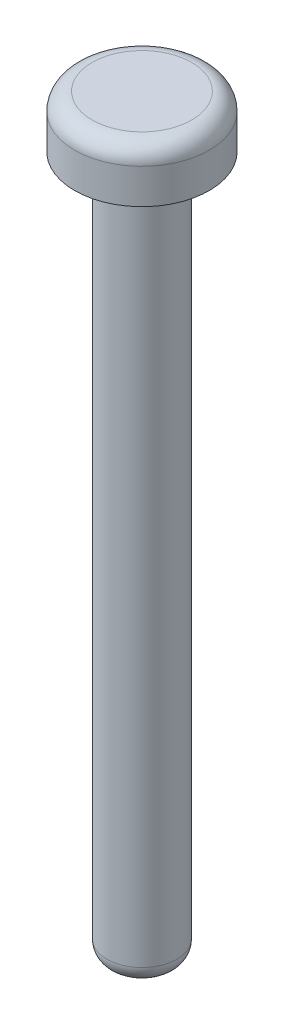
ISO-10303-21;
HEADER;
FILE_DESCRIPTION(('STEP AP214'),'2;1');
FILE_NAME('part.step','',(''),(''),'','','');
FILE_SCHEMA(('AUTOMOTIVE_DESIGN { 1 0 10303 214 1 1 1 1 }'));
ENDSEC;
DATA;
#1=APPLICATION_CONTEXT('core data for automotive mechanical design processes');
#2=APPLICATION_PROTOCOL_DEFINITION('international standard','automotive_design',2000,#1);
#3=PRODUCT_CONTEXT('',#1,'mechanical');
#4=PRODUCT('Part','Part','',(#3));
#5=PRODUCT_RELATED_PRODUCT_CATEGORY('part','',(#4));
#6=PRODUCT_DEFINITION_FORMATION('','',#4);
#7=PRODUCT_DEFINITION_CONTEXT('part definition',#1,'design');
#8=PRODUCT_DEFINITION('design','',#6,#7);
#9=PRODUCT_DEFINITION_SHAPE('','',#8);
#10=(LENGTH_UNIT() NAMED_UNIT(*) SI_UNIT(.MILLI.,.METRE.));
#11=(NAMED_UNIT(*) PLANE_ANGLE_UNIT() SI_UNIT($,.RADIAN.));
#12=(NAMED_UNIT(*) SI_UNIT($,.STERADIAN.) SOLID_ANGLE_UNIT());
#13=UNCERTAINTY_MEASURE_WITH_UNIT(LENGTH_MEASURE(1.E-05),#10,'distance_accuracy_value','');
#14=(GEOMETRIC_REPRESENTATION_CONTEXT(3) GLOBAL_UNCERTAINTY_ASSIGNED_CONTEXT((#13)) GLOBAL_UNIT_ASSIGNED_CONTEXT((#10,
#11,#12)) REPRESENTATION_CONTEXT('',''));
#15=CARTESIAN_POINT('',(0.,0.,0.));
#16=DIRECTION('',(0.,0.,1.));
#17=DIRECTION('',(1.,0.,0.));
#18=AXIS2_PLACEMENT_3D('',#15,#16,#17);
#19=CARTESIAN_POINT('',(0.,40.,0.));
#20=DIRECTION('',(0.,-1.,0.));
#21=DIRECTION('',(0.,0.,-1.));
#22=AXIS2_PLACEMENT_3D('',#19,#20,#21);
#23=CYLINDRICAL_SURFACE('',#22,2.);
#24=CARTESIAN_POINT('',(0.,1.,0.));
#25=DIRECTION('',(0.,1.,0.));
#26=DIRECTION('',(0.,0.,1.));
#27=AXIS2_PLACEMENT_3D('',#24,#25,#26);
#28=CIRCLE('',#27,2.);
#29=CARTESIAN_POINT('',(0.,1.,2.));
#30=VERTEX_POINT('',#29);
#31=EDGE_CURVE('E43',#30,#30,#28,.T.);
#32=ORIENTED_EDGE('',*,*,#31,.T.);
#33=EDGE_LOOP('',(#32));
#34=FACE_BOUND('',#33,.T.);
#35=CARTESIAN_POINT('',(0.,39.,0.));
#36=DIRECTION('',(0.,1.,0.));
#37=DIRECTION('',(0.,0.,1.));
#38=AXIS2_PLACEMENT_3D('',#35,#36,#37);
#39=CIRCLE('',#38,2.);
#40=CARTESIAN_POINT('',(0.,39.,2.));
#41=VERTEX_POINT('',#40);
#42=EDGE_CURVE('E47',#41,#41,#39,.F.);
#43=ORIENTED_EDGE('',*,*,#42,.T.);
#44=EDGE_LOOP('',(#43));
#45=FACE_BOUND('',#44,.T.);
#46=ADVANCED_FACE('F32',(#34,#45),#23,.T.);
#47=CARTESIAN_POINT('',(0.,0.,0.));
#48=DIRECTION('',(0.,1.,0.));
#49=DIRECTION('',(0.,0.,1.));
#50=AXIS2_PLACEMENT_3D('',#47,#48,#49);
#51=PLANE('',#50);
#52=CARTESIAN_POINT('',(0.,0.,0.));
#53=DIRECTION('',(0.,1.,0.));
#54=DIRECTION('',(0.,0.,1.));
#55=AXIS2_PLACEMENT_3D('',#52,#53,#54);
#56=CIRCLE('',#55,1.);
#57=CARTESIAN_POINT('',(0.,0.,1.));
#58=VERTEX_POINT('',#57);
#59=EDGE_CURVE('E39',#58,#58,#56,.F.);
#60=ORIENTED_EDGE('',*,*,#59,.T.);
#61=EDGE_LOOP('',(#60));
#62=FACE_BOUND('',#61,.T.);
#63=ADVANCED_FACE('F80',(#62),#51,.F.);
#64=CARTESIAN_POINT('',(0.,43.,0.));
#65=DIRECTION('',(0.,-1.,0.));
#66=DIRECTION('',(0.,0.,-1.));
#67=AXIS2_PLACEMENT_3D('',#64,#65,#66);
#68=CYLINDRICAL_SURFACE('',#67,3.85);
#69=CARTESIAN_POINT('',(0.,42.,0.));
#70=DIRECTION('',(0.,1.,0.));
#71=DIRECTION('',(0.,0.,1.));
#72=AXIS2_PLACEMENT_3D('',#69,#70,#71);
#73=CIRCLE('',#72,3.85);
#74=CARTESIAN_POINT('',(0.,42.,3.85));
#75=VERTEX_POINT('',#74);
#76=EDGE_CURVE('E52',#75,#75,#73,.F.);
#77=ORIENTED_EDGE('',*,*,#76,.T.);
#78=EDGE_LOOP('',(#77));
#79=FACE_BOUND('',#78,.T.);
#80=CARTESIAN_POINT('',(0.,40.,0.));
#81=DIRECTION('',(0.,1.,0.));
#82=DIRECTION('',(0.,0.,1.));
#83=AXIS2_PLACEMENT_3D('',#80,#81,#82);
#84=CIRCLE('',#83,3.85);
#85=CARTESIAN_POINT('',(0.,40.,3.85));
#86=VERTEX_POINT('',#85);
#87=EDGE_CURVE('E58',#86,#86,#84,.T.);
#88=ORIENTED_EDGE('',*,*,#87,.T.);
#89=EDGE_LOOP('',(#88));
#90=FACE_BOUND('',#89,.T.);
#91=ADVANCED_FACE('F62',(#79,#90),#68,.T.);
#92=CARTESIAN_POINT('',(0.,43.,0.));
#93=DIRECTION('',(0.,1.,0.));
#94=DIRECTION('',(0.,0.,1.));
#95=AXIS2_PLACEMENT_3D('',#92,#93,#94);
#96=PLANE('',#95);
#97=CARTESIAN_POINT('',(0.,43.,0.));
#98=DIRECTION('',(0.,1.,0.));
#99=DIRECTION('',(0.,0.,1.));
#100=AXIS2_PLACEMENT_3D('',#97,#98,#99);
#101=CIRCLE('',#100,2.85);
#102=CARTESIAN_POINT('',(0.,43.,2.85));
#103=VERTEX_POINT('',#102);
#104=EDGE_CURVE('E55',#103,#103,#101,.T.);
#105=ORIENTED_EDGE('',*,*,#104,.T.);
#106=EDGE_LOOP('',(#105));
#107=FACE_BOUND('',#106,.T.);
#108=ADVANCED_FACE('F67',(#107),#96,.T.);
#109=CARTESIAN_POINT('',(0.,40.,0.));
#110=DIRECTION('',(0.,1.,0.));
#111=DIRECTION('',(0.,0.,1.));
#112=AXIS2_PLACEMENT_3D('',#109,#110,#111);
#113=PLANE('',#112);
#114=CARTESIAN_POINT('',(0.,40.,0.));
#115=DIRECTION('',(0.,1.,0.));
#116=DIRECTION('',(0.,0.,1.));
#117=AXIS2_PLACEMENT_3D('',#114,#115,#116);
#118=CIRCLE('',#117,3.);
#119=CARTESIAN_POINT('',(0.,40.,3.));
#120=VERTEX_POINT('',#119);
#121=EDGE_CURVE('E10',#120,#120,#118,.T.);
#122=ORIENTED_EDGE('',*,*,#121,.T.);
#123=EDGE_LOOP('',(#122));
#124=FACE_BOUND('',#123,.T.);
#125=ORIENTED_EDGE('',*,*,#87,.F.);
#126=EDGE_LOOP('',(#125));
#127=FACE_BOUND('',#126,.T.);
#128=ADVANCED_FACE('F64',(#124,#127),#113,.F.);
#129=CARTESIAN_POINT('',(0.,42.,0.));
#130=DIRECTION('',(0.,1.,0.));
#131=DIRECTION('',(0.,0.,1.));
#132=AXIS2_PLACEMENT_3D('',#129,#130,#131);
#133=TOROIDAL_SURFACE('',#132,2.85,1.);
#134=ORIENTED_EDGE('',*,*,#76,.F.);
#135=EDGE_LOOP('',(#134));
#136=FACE_BOUND('',#135,.T.);
#137=ORIENTED_EDGE('',*,*,#104,.F.);
#138=EDGE_LOOP('',(#137));
#139=FACE_BOUND('',#138,.T.);
#140=ADVANCED_FACE('F66',(#136,#139),#133,.T.);
#141=CARTESIAN_POINT('',(0.,1.,0.));
#142=DIRECTION('',(0.,1.,0.));
#143=DIRECTION('',(0.,0.,1.));
#144=AXIS2_PLACEMENT_3D('',#141,#142,#143);
#145=DEGENERATE_TOROIDAL_SURFACE('',#144,1.,1.,.T.);
#146=ORIENTED_EDGE('',*,*,#59,.F.);
#147=EDGE_LOOP('',(#146));
#148=FACE_BOUND('',#147,.T.);
#149=ORIENTED_EDGE('',*,*,#31,.F.);
#150=EDGE_LOOP('',(#149));
#151=FACE_BOUND('',#150,.T.);
#152=ADVANCED_FACE('F73',(#148,#151),#145,.T.);
#153=CARTESIAN_POINT('',(0.,39.,0.));
#154=DIRECTION('',(0.,1.,0.));
#155=DIRECTION('',(0.,0.,1.));
#156=AXIS2_PLACEMENT_3D('',#153,#154,#155);
#157=TOROIDAL_SURFACE('',#156,3.,1.);
#158=ORIENTED_EDGE('',*,*,#42,.F.);
#159=EDGE_LOOP('',(#158));
#160=FACE_BOUND('',#159,.T.);
#161=ORIENTED_EDGE('',*,*,#121,.F.);
#162=EDGE_LOOP('',(#161));
#163=FACE_BOUND('',#162,.T.);
#164=ADVANCED_FACE('F34',(#160,#163),#157,.F.);
#165=CLOSED_SHELL('',(#46,#63,#91,#108,#128,#140,#152,#164));
#166=MANIFOLD_SOLID_BREP('B2',#165);
#167=ADVANCED_BREP_SHAPE_REPRESENTATION('',(#18,#166),#14);
#168=SHAPE_DEFINITION_REPRESENTATION(#9,#167);
ENDSEC;
END-ISO-10303-21;
